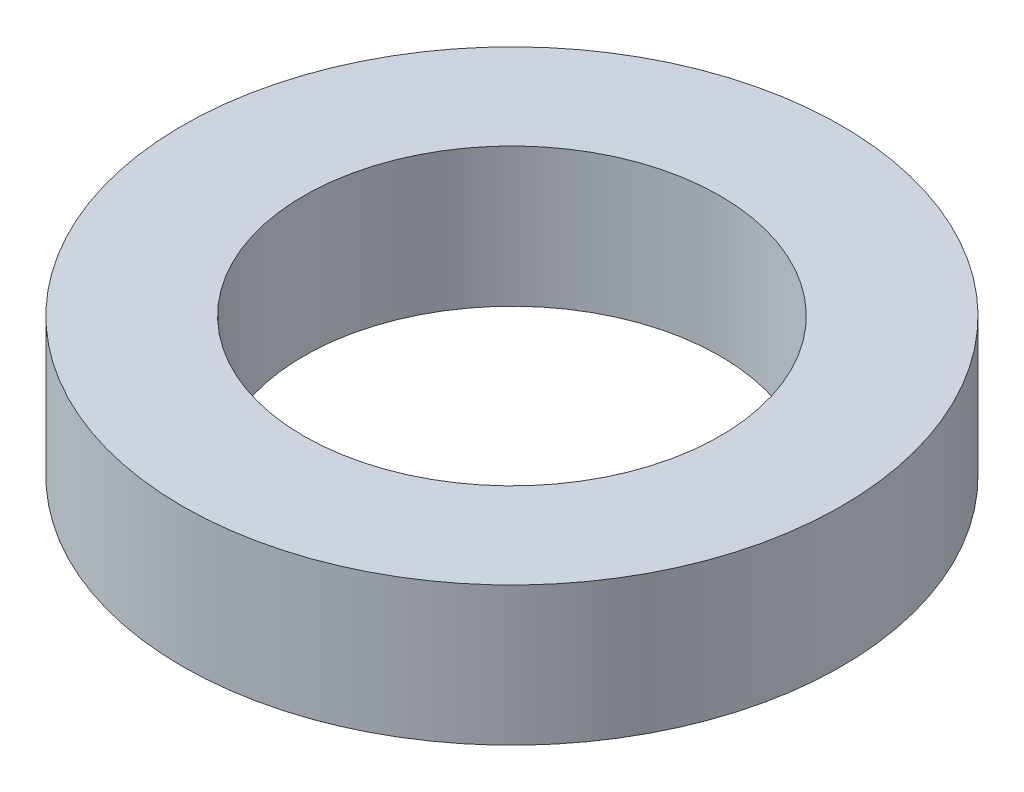
ISO-10303-21;
HEADER;
FILE_DESCRIPTION(('STEP AP214'),'2;1');
FILE_NAME('part.step','',(''),(''),'','','');
FILE_SCHEMA(('AUTOMOTIVE_DESIGN { 1 0 10303 214 1 1 1 1 }'));
ENDSEC;
DATA;
#1=APPLICATION_CONTEXT('core data for automotive mechanical design processes');
#2=APPLICATION_PROTOCOL_DEFINITION('international standard','automotive_design',2000,#1);
#3=PRODUCT_CONTEXT('',#1,'mechanical');
#4=PRODUCT('Part','Part','',(#3));
#5=PRODUCT_RELATED_PRODUCT_CATEGORY('part','',(#4));
#6=PRODUCT_DEFINITION_FORMATION('','',#4);
#7=PRODUCT_DEFINITION_CONTEXT('part definition',#1,'design');
#8=PRODUCT_DEFINITION('design','',#6,#7);
#9=PRODUCT_DEFINITION_SHAPE('','',#8);
#10=(LENGTH_UNIT() NAMED_UNIT(*) SI_UNIT(.MILLI.,.METRE.));
#11=(NAMED_UNIT(*) PLANE_ANGLE_UNIT() SI_UNIT($,.RADIAN.));
#12=(NAMED_UNIT(*) SI_UNIT($,.STERADIAN.) SOLID_ANGLE_UNIT());
#13=UNCERTAINTY_MEASURE_WITH_UNIT(LENGTH_MEASURE(1.E-05),#10,'distance_accuracy_value','');
#14=(GEOMETRIC_REPRESENTATION_CONTEXT(3) GLOBAL_UNCERTAINTY_ASSIGNED_CONTEXT((#13)) GLOBAL_UNIT_ASSIGNED_CONTEXT((#10,
#11,#12)) REPRESENTATION_CONTEXT('',''));
#15=CARTESIAN_POINT('',(0.,0.,0.));
#16=DIRECTION('',(0.,0.,1.));
#17=DIRECTION('',(1.,0.,0.));
#18=AXIS2_PLACEMENT_3D('',#15,#16,#17);
#19=CARTESIAN_POINT('',(0.,20.,0.));
#20=DIRECTION('',(0.,-1.,0.));
#21=DIRECTION('',(0.,0.,-1.));
#22=AXIS2_PLACEMENT_3D('',#19,#20,#21);
#23=CYLINDRICAL_SURFACE('',#22,47.5);
#24=CARTESIAN_POINT('',(0.,20.,0.));
#25=DIRECTION('',(0.,1.,0.));
#26=DIRECTION('',(0.,0.,1.));
#27=AXIS2_PLACEMENT_3D('',#24,#25,#26);
#28=CIRCLE('',#27,47.5);
#29=CARTESIAN_POINT('',(0.,20.,47.5));
#30=VERTEX_POINT('',#29);
#31=EDGE_CURVE('E10',#30,#30,#28,.T.);
#32=ORIENTED_EDGE('',*,*,#31,.F.);
#33=EDGE_LOOP('',(#32));
#34=FACE_BOUND('',#33,.T.);
#35=CARTESIAN_POINT('',(0.,0.,0.));
#36=DIRECTION('',(0.,1.,0.));
#37=DIRECTION('',(0.,0.,1.));
#38=AXIS2_PLACEMENT_3D('',#35,#36,#37);
#39=CIRCLE('',#38,47.5);
#40=CARTESIAN_POINT('',(0.,0.,47.5));
#41=VERTEX_POINT('',#40);
#42=EDGE_CURVE('E37',#41,#41,#39,.T.);
#43=ORIENTED_EDGE('',*,*,#42,.T.);
#44=EDGE_LOOP('',(#43));
#45=FACE_BOUND('',#44,.T.);
#46=ADVANCED_FACE('F40',(#34,#45),#23,.T.);
#47=CARTESIAN_POINT('',(0.,20.,0.));
#48=DIRECTION('',(0.,1.,0.));
#49=DIRECTION('',(0.,0.,1.));
#50=AXIS2_PLACEMENT_3D('',#47,#48,#49);
#51=PLANE('',#50);
#52=CARTESIAN_POINT('',(0.,20.,0.));
#53=DIRECTION('',(0.,1.,0.));
#54=DIRECTION('',(0.,0.,1.));
#55=AXIS2_PLACEMENT_3D('',#52,#53,#54);
#56=CIRCLE('',#55,30.);
#57=CARTESIAN_POINT('',(0.,20.,30.));
#58=VERTEX_POINT('',#57);
#59=EDGE_CURVE('E50',#58,#58,#56,.T.);
#60=ORIENTED_EDGE('',*,*,#59,.F.);
#61=EDGE_LOOP('',(#60));
#62=FACE_BOUND('',#61,.T.);
#63=ORIENTED_EDGE('',*,*,#31,.T.);
#64=EDGE_LOOP('',(#63));
#65=FACE_BOUND('',#64,.T.);
#66=ADVANCED_FACE('F59',(#62,#65),#51,.T.);
#67=CARTESIAN_POINT('',(0.,0.,0.));
#68=DIRECTION('',(0.,1.,0.));
#69=DIRECTION('',(0.,0.,1.));
#70=AXIS2_PLACEMENT_3D('',#67,#68,#69);
#71=PLANE('',#70);
#72=CARTESIAN_POINT('',(0.,0.,0.));
#73=DIRECTION('',(0.,1.,0.));
#74=DIRECTION('',(0.,0.,1.));
#75=AXIS2_PLACEMENT_3D('',#72,#73,#74);
#76=CIRCLE('',#75,30.);
#77=CARTESIAN_POINT('',(0.,0.,30.));
#78=VERTEX_POINT('',#77);
#79=EDGE_CURVE('E47',#78,#78,#76,.T.);
#80=ORIENTED_EDGE('',*,*,#79,.T.);
#81=EDGE_LOOP('',(#80));
#82=FACE_BOUND('',#81,.T.);
#83=ORIENTED_EDGE('',*,*,#42,.F.);
#84=EDGE_LOOP('',(#83));
#85=FACE_BOUND('',#84,.T.);
#86=ADVANCED_FACE('F58',(#82,#85),#71,.F.);
#87=CARTESIAN_POINT('',(0.,20.,0.));
#88=DIRECTION('',(0.,-1.,0.));
#89=DIRECTION('',(0.,0.,-1.));
#90=AXIS2_PLACEMENT_3D('',#87,#88,#89);
#91=CYLINDRICAL_SURFACE('',#90,30.);
#92=ORIENTED_EDGE('',*,*,#59,.T.);
#93=EDGE_LOOP('',(#92));
#94=FACE_BOUND('',#93,.T.);
#95=ORIENTED_EDGE('',*,*,#79,.F.);
#96=EDGE_LOOP('',(#95));
#97=FACE_BOUND('',#96,.T.);
#98=ADVANCED_FACE('F54',(#94,#97),#91,.F.);
#99=CLOSED_SHELL('',(#46,#66,#86,#98));
#100=MANIFOLD_SOLID_BREP('B2',#99);
#101=ADVANCED_BREP_SHAPE_REPRESENTATION('',(#18,#100),#14);
#102=SHAPE_DEFINITION_REPRESENTATION(#9,#101);
ENDSEC;
END-ISO-10303-21;
